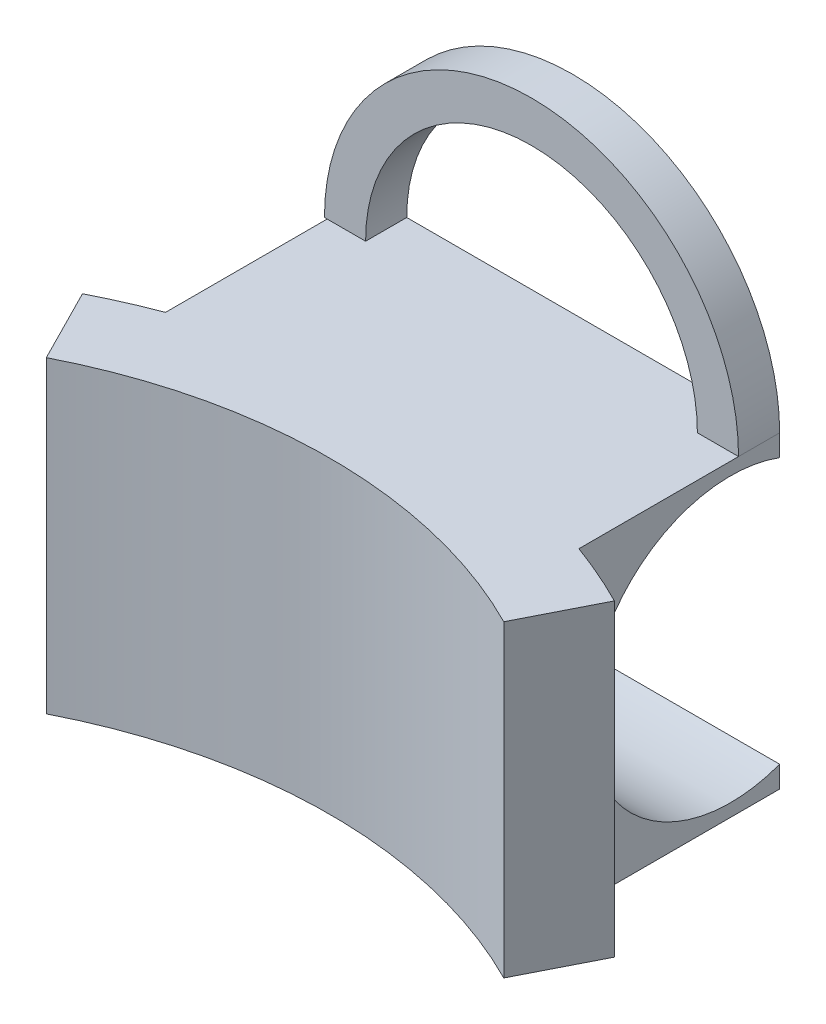
ISO-10303-21;
HEADER;
FILE_DESCRIPTION(('STEP AP214'),'2;1');
FILE_NAME('part.step','',(''),(''),'','','');
FILE_SCHEMA(('AUTOMOTIVE_DESIGN { 1 0 10303 214 1 1 1 1 }'));
ENDSEC;
DATA;
#1=APPLICATION_CONTEXT('core data for automotive mechanical design processes');
#2=APPLICATION_PROTOCOL_DEFINITION('international standard','automotive_design',2000,#1);
#3=PRODUCT_CONTEXT('',#1,'mechanical');
#4=PRODUCT('Part','Part','',(#3));
#5=PRODUCT_RELATED_PRODUCT_CATEGORY('part','',(#4));
#6=PRODUCT_DEFINITION_FORMATION('','',#4);
#7=PRODUCT_DEFINITION_CONTEXT('part definition',#1,'design');
#8=PRODUCT_DEFINITION('design','',#6,#7);
#9=PRODUCT_DEFINITION_SHAPE('','',#8);
#10=(LENGTH_UNIT() NAMED_UNIT(*) SI_UNIT(.MILLI.,.METRE.));
#11=(NAMED_UNIT(*) PLANE_ANGLE_UNIT() SI_UNIT($,.RADIAN.));
#12=(NAMED_UNIT(*) SI_UNIT($,.STERADIAN.) SOLID_ANGLE_UNIT());
#13=UNCERTAINTY_MEASURE_WITH_UNIT(LENGTH_MEASURE(1.E-05),#10,'distance_accuracy_value','');
#14=(GEOMETRIC_REPRESENTATION_CONTEXT(3) GLOBAL_UNCERTAINTY_ASSIGNED_CONTEXT((#13)) GLOBAL_UNIT_ASSIGNED_CONTEXT((#10,
#11,#12)) REPRESENTATION_CONTEXT('',''));
#15=CARTESIAN_POINT('',(0.,0.,0.));
#16=DIRECTION('',(0.,0.,1.));
#17=DIRECTION('',(1.,0.,0.));
#18=AXIS2_PLACEMENT_3D('',#15,#16,#17);
#19=CARTESIAN_POINT('',(0.,0.,0.));
#20=DIRECTION('',(0.,1.,0.));
#21=DIRECTION('',(0.,0.,1.));
#22=AXIS2_PLACEMENT_3D('',#19,#20,#21);
#23=PLANE('',#22);
#24=DIRECTION('',(-1.,0.,0.));
#25=VECTOR('',#24,1.);
#26=CARTESIAN_POINT('',(-6.35,0.,0.));
#27=LINE('',#26,#25);
#28=CARTESIAN_POINT('',(5.08,0.,0.));
#29=VERTEX_POINT('',#28);
#30=CARTESIAN_POINT('',(-5.16308789777071,0.,0.));
#31=VERTEX_POINT('',#30);
#32=EDGE_CURVE('E236',#29,#31,#27,.T.);
#33=ORIENTED_EDGE('',*,*,#32,.T.);
#34=DIRECTION('',(0.,0.,-1.));
#35=VECTOR('',#34,1.);
#36=CARTESIAN_POINT('',(-5.16308789777071,0.,1.27));
#37=LINE('',#36,#35);
#38=CARTESIAN_POINT('',(-5.16308789777071,0.,1.27));
#39=VERTEX_POINT('',#38);
#40=EDGE_CURVE('E64',#39,#31,#37,.T.);
#41=ORIENTED_EDGE('',*,*,#40,.F.);
#42=DIRECTION('',(-1.,0.,0.));
#43=VECTOR('',#42,1.);
#44=CARTESIAN_POINT('',(-5.16308789777071,0.,1.27));
#45=LINE('',#44,#43);
#46=CARTESIAN_POINT('',(-6.35,0.,1.27));
#47=VERTEX_POINT('',#46);
#48=EDGE_CURVE('E161',#39,#47,#45,.T.);
#49=ORIENTED_EDGE('',*,*,#48,.T.);
#50=DIRECTION('',(0.,0.,1.));
#51=VECTOR('',#50,1.);
#52=CARTESIAN_POINT('',(-6.35,0.,0.));
#53=LINE('',#52,#51);
#54=CARTESIAN_POINT('',(-6.35,0.,6.25854232944159));
#55=VERTEX_POINT('',#54);
#56=EDGE_CURVE('E231',#47,#55,#53,.T.);
#57=ORIENTED_EDGE('',*,*,#56,.T.);
#58=CARTESIAN_POINT('',(0.0816708780940097,0.,23.219082168846));
#59=DIRECTION('',(0.,1.,0.));
#60=DIRECTION('',(1.,0.,0.));
#61=AXIS2_PLACEMENT_3D('',#58,#59,#60);
#62=CIRCLE('',#61,18.139082168846);
#63=CARTESIAN_POINT('',(-8.12945462790108,0.,7.04491387947347));
#64=VERTEX_POINT('',#63);
#65=EDGE_CURVE('E212',#64,#55,#62,.F.);
#66=ORIENTED_EDGE('',*,*,#65,.F.);
#67=DIRECTION('',(-0.45267590882287,0.,-0.891675121090293));
#68=VECTOR('',#67,1.);
#69=CARTESIAN_POINT('',(-6.97965781949099,0.,9.30976868704282));
#70=LINE('',#69,#68);
#71=CARTESIAN_POINT('',(-6.97965781949099,0.,9.30976868704282));
#72=VERTEX_POINT('',#71);
#73=EDGE_CURVE('E197',#72,#64,#70,.T.);
#74=ORIENTED_EDGE('',*,*,#73,.F.);
#75=CARTESIAN_POINT('',(0.0816708780940097,0.,23.219082168846));
#76=DIRECTION('',(0.,1.,0.));
#77=DIRECTION('',(1.,0.,0.));
#78=AXIS2_PLACEMENT_3D('',#75,#76,#77);
#79=CIRCLE('',#78,15.599082168846);
#80=CARTESIAN_POINT('',(7.142999575679,0.,9.30976868704282));
#81=VERTEX_POINT('',#80);
#82=EDGE_CURVE('E192',#72,#81,#79,.F.);
#83=ORIENTED_EDGE('',*,*,#82,.T.);
#84=DIRECTION('',(-0.45267590882287,0.,0.891675121090293));
#85=VECTOR('',#84,1.);
#86=CARTESIAN_POINT('',(8.29279638408909,0.,7.04491387947347));
#87=LINE('',#86,#85);
#88=CARTESIAN_POINT('',(8.29279638408909,0.,7.04491387947347));
#89=VERTEX_POINT('',#88);
#90=EDGE_CURVE('E208',#89,#81,#87,.T.);
#91=ORIENTED_EDGE('',*,*,#90,.F.);
#92=CARTESIAN_POINT('',(6.35,0.,6.19749728530439));
#93=VERTEX_POINT('',#92);
#94=EDGE_CURVE('E211',#93,#89,#62,.F.);
#95=ORIENTED_EDGE('',*,*,#94,.F.);
#96=DIRECTION('',(0.,0.,-1.));
#97=VECTOR('',#96,1.);
#98=CARTESIAN_POINT('',(6.35,0.,0.));
#99=LINE('',#98,#97);
#100=CARTESIAN_POINT('',(6.35,0.,1.27));
#101=VERTEX_POINT('',#100);
#102=EDGE_CURVE('E243',#93,#101,#99,.T.);
#103=ORIENTED_EDGE('',*,*,#102,.T.);
#104=DIRECTION('',(-1.,0.,0.));
#105=VECTOR('',#104,1.);
#106=CARTESIAN_POINT('',(6.35,0.,1.27));
#107=LINE('',#106,#105);
#108=CARTESIAN_POINT('',(5.08,0.,1.27));
#109=VERTEX_POINT('',#108);
#110=EDGE_CURVE('E71',#101,#109,#107,.T.);
#111=ORIENTED_EDGE('',*,*,#110,.T.);
#112=DIRECTION('',(0.,0.,-1.));
#113=VECTOR('',#112,1.);
#114=CARTESIAN_POINT('',(5.08,0.,1.27));
#115=LINE('',#114,#113);
#116=EDGE_CURVE('E186',#109,#29,#115,.T.);
#117=ORIENTED_EDGE('',*,*,#116,.T.);
#118=EDGE_LOOP('',(#33,#41,#49,#57,#66,#74,#83,#91,#95,#103,#111,#117));
#119=FACE_BOUND('',#118,.T.);
#120=ADVANCED_FACE('F49',(#119),#23,.T.);
#121=CARTESIAN_POINT('',(-6.35,-9.525,0.));
#122=DIRECTION('',(0.,0.,-1.));
#123=DIRECTION('',(-1.,0.,0.));
#124=AXIS2_PLACEMENT_3D('',#121,#122,#123);
#125=PLANE('',#124);
#126=DIRECTION('',(0.,1.,0.));
#127=VECTOR('',#126,1.);
#128=CARTESIAN_POINT('',(-6.35,-9.525,0.));
#129=LINE('',#128,#127);
#130=CARTESIAN_POINT('',(-6.35,-0.664253574886776,0.));
#131=VERTEX_POINT('',#130);
#132=CARTESIAN_POINT('',(-6.35,0.,0.));
#133=VERTEX_POINT('',#132);
#134=EDGE_CURVE('E249',#131,#133,#129,.T.);
#135=ORIENTED_EDGE('',*,*,#134,.T.);
#136=DIRECTION('',(-1.,0.,0.));
#137=VECTOR('',#136,1.);
#138=CARTESIAN_POINT('',(-5.16308789777071,0.,0.));
#139=LINE('',#138,#137);
#140=CARTESIAN_POINT('',(-6.43308789777071,0.,0.));
#141=VERTEX_POINT('',#140);
#142=EDGE_CURVE('E182',#133,#141,#139,.T.);
#143=ORIENTED_EDGE('',*,*,#142,.T.);
#144=CARTESIAN_POINT('',(-0.0415439488853568,0.,0.));
#145=DIRECTION('',(0.,0.,-1.));
#146=DIRECTION('',(-1.,0.,0.));
#147=AXIS2_PLACEMENT_3D('',#144,#145,#146);
#148=CIRCLE('',#147,6.39154394888536);
#149=CARTESIAN_POINT('',(6.35,0.,0.));
#150=VERTEX_POINT('',#149);
#151=EDGE_CURVE('E169',#141,#150,#148,.T.);
#152=ORIENTED_EDGE('',*,*,#151,.T.);
#153=DIRECTION('',(0.,1.,0.));
#154=VECTOR('',#153,1.);
#155=CARTESIAN_POINT('',(6.35,-9.525,0.));
#156=LINE('',#155,#154);
#157=CARTESIAN_POINT('',(6.35,-0.664253574886776,0.));
#158=VERTEX_POINT('',#157);
#159=EDGE_CURVE('E241',#158,#150,#156,.T.);
#160=ORIENTED_EDGE('',*,*,#159,.F.);
#161=DIRECTION('',(1.,0.,0.));
#162=VECTOR('',#161,1.);
#163=CARTESIAN_POINT('',(-8.12945462790108,-0.664253574886776,0.));
#164=LINE('',#163,#162);
#165=EDGE_CURVE('E13',#131,#158,#164,.T.);
#166=ORIENTED_EDGE('',*,*,#165,.F.);
#167=EDGE_LOOP('',(#135,#143,#152,#160,#166));
#168=FACE_BOUND('',#167,.T.);
#169=CARTESIAN_POINT('',(-0.0415439488853568,0.,0.));
#170=DIRECTION('',(0.,0.,1.));
#171=DIRECTION('',(1.,0.,0.));
#172=AXIS2_PLACEMENT_3D('',#169,#170,#171);
#173=CIRCLE('',#172,5.12154394888536);
#174=EDGE_CURVE('E178',#31,#29,#173,.F.);
#175=ORIENTED_EDGE('',*,*,#174,.F.);
#176=ORIENTED_EDGE('',*,*,#32,.F.);
#177=EDGE_LOOP('',(#175,#176));
#178=FACE_BOUND('',#177,.T.);
#179=ADVANCED_FACE('F282',(#168,#178),#125,.T.);
#180=CARTESIAN_POINT('',(-6.35,-9.525,0.));
#181=DIRECTION('',(-1.,0.,0.));
#182=DIRECTION('',(0.,0.,1.));
#183=AXIS2_PLACEMENT_3D('',#180,#181,#182);
#184=PLANE('',#183);
#185=CARTESIAN_POINT('',(-6.35,-4.7625,1.51703384428801));
#186=DIRECTION('',(-1.,0.,0.));
#187=DIRECTION('',(0.,0.,1.));
#188=AXIS2_PLACEMENT_3D('',#185,#186,#187);
#189=CIRCLE('',#188,4.3700132088666);
#190=CARTESIAN_POINT('',(-6.35,-8.86074642511323,0.));
#191=VERTEX_POINT('',#190);
#192=EDGE_CURVE('E190',#191,#131,#189,.T.);
#193=ORIENTED_EDGE('',*,*,#192,.F.);
#194=CARTESIAN_POINT('',(-6.35,-9.525,0.));
#195=VERTEX_POINT('',#194);
#196=EDGE_CURVE('E246',#195,#191,#129,.T.);
#197=ORIENTED_EDGE('',*,*,#196,.F.);
#198=DIRECTION('',(0.,0.,1.));
#199=VECTOR('',#198,1.);
#200=CARTESIAN_POINT('',(-6.35,-9.525,0.));
#201=LINE('',#200,#199);
#202=CARTESIAN_POINT('',(-6.35,-9.525,6.25854232944159));
#203=VERTEX_POINT('',#202);
#204=EDGE_CURVE('E232',#195,#203,#201,.T.);
#205=ORIENTED_EDGE('',*,*,#204,.T.);
#206=DIRECTION('',(0.,1.,0.));
#207=VECTOR('',#206,1.);
#208=CARTESIAN_POINT('',(-6.35,-9.525,6.25854232944159));
#209=LINE('',#208,#207);
#210=EDGE_CURVE('E228',#203,#55,#209,.T.);
#211=ORIENTED_EDGE('',*,*,#210,.T.);
#212=ORIENTED_EDGE('',*,*,#56,.F.);
#213=EDGE_CURVE('E157',#133,#47,#53,.T.);
#214=ORIENTED_EDGE('',*,*,#213,.F.);
#215=ORIENTED_EDGE('',*,*,#134,.F.);
#216=EDGE_LOOP('',(#193,#197,#205,#211,#212,#214,#215));
#217=FACE_BOUND('',#216,.T.);
#218=ADVANCED_FACE('F51',(#217),#184,.T.);
#219=CARTESIAN_POINT('',(6.35,-9.525,0.));
#220=DIRECTION('',(1.,0.,0.));
#221=DIRECTION('',(0.,0.,-1.));
#222=AXIS2_PLACEMENT_3D('',#219,#220,#221);
#223=PLANE('',#222);
#224=CARTESIAN_POINT('',(6.35,-4.7625,1.51703384428801));
#225=DIRECTION('',(1.,0.,0.));
#226=DIRECTION('',(0.,0.,-1.));
#227=AXIS2_PLACEMENT_3D('',#224,#225,#226);
#228=CIRCLE('',#227,4.3700132088666);
#229=CARTESIAN_POINT('',(6.35,-8.86074642511323,0.));
#230=VERTEX_POINT('',#229);
#231=EDGE_CURVE('E188',#158,#230,#228,.T.);
#232=ORIENTED_EDGE('',*,*,#231,.F.);
#233=ORIENTED_EDGE('',*,*,#159,.T.);
#234=DIRECTION('',(0.,0.,-1.));
#235=VECTOR('',#234,1.);
#236=CARTESIAN_POINT('',(6.35,0.,1.27));
#237=LINE('',#236,#235);
#238=EDGE_CURVE('E170',#101,#150,#237,.T.);
#239=ORIENTED_EDGE('',*,*,#238,.F.);
#240=ORIENTED_EDGE('',*,*,#102,.F.);
#241=DIRECTION('',(0.,1.,0.));
#242=VECTOR('',#241,1.);
#243=CARTESIAN_POINT('',(6.35,-9.525,6.1974972853044));
#244=LINE('',#243,#242);
#245=CARTESIAN_POINT('',(6.35,-9.525,6.19749728530439));
#246=VERTEX_POINT('',#245);
#247=EDGE_CURVE('E218',#93,#246,#244,.F.);
#248=ORIENTED_EDGE('',*,*,#247,.T.);
#249=DIRECTION('',(0.,0.,-1.));
#250=VECTOR('',#249,1.);
#251=CARTESIAN_POINT('',(6.35,-9.525,0.));
#252=LINE('',#251,#250);
#253=CARTESIAN_POINT('',(6.35,-9.525,0.));
#254=VERTEX_POINT('',#253);
#255=EDGE_CURVE('E235',#246,#254,#252,.T.);
#256=ORIENTED_EDGE('',*,*,#255,.T.);
#257=EDGE_CURVE('E250',#254,#230,#156,.T.);
#258=ORIENTED_EDGE('',*,*,#257,.T.);
#259=EDGE_LOOP('',(#232,#233,#239,#240,#248,#256,#258));
#260=FACE_BOUND('',#259,.T.);
#261=ADVANCED_FACE('F290',(#260),#223,.T.);
#262=DIRECTION('',(1.,0.,0.));
#263=VECTOR('',#262,1.);
#264=CARTESIAN_POINT('',(-8.12945462790108,-8.86074642511323,0.));
#265=LINE('',#264,#263);
#266=EDGE_CURVE('E57',#230,#191,#265,.F.);
#267=ORIENTED_EDGE('',*,*,#266,.F.);
#268=ORIENTED_EDGE('',*,*,#257,.F.);
#269=DIRECTION('',(-1.,0.,0.));
#270=VECTOR('',#269,1.);
#271=CARTESIAN_POINT('',(-6.35,-9.525,0.));
#272=LINE('',#271,#270);
#273=EDGE_CURVE('E238',#254,#195,#272,.T.);
#274=ORIENTED_EDGE('',*,*,#273,.T.);
#275=ORIENTED_EDGE('',*,*,#196,.T.);
#276=EDGE_LOOP('',(#267,#268,#274,#275));
#277=FACE_BOUND('',#276,.T.);
#278=ADVANCED_FACE('F264',(#277),#125,.T.);
#279=CARTESIAN_POINT('',(0.,-9.525,0.));
#280=DIRECTION('',(0.,1.,0.));
#281=DIRECTION('',(0.,0.,1.));
#282=AXIS2_PLACEMENT_3D('',#279,#280,#281);
#283=PLANE('',#282);
#284=ORIENTED_EDGE('',*,*,#255,.F.);
#285=CARTESIAN_POINT('',(0.0816708780940097,-9.525,23.219082168846));
#286=DIRECTION('',(0.,1.,0.));
#287=DIRECTION('',(1.,0.,0.));
#288=AXIS2_PLACEMENT_3D('',#285,#286,#287);
#289=CIRCLE('',#288,18.139082168846);
#290=CARTESIAN_POINT('',(8.29279638408909,-9.525,7.04491387947347));
#291=VERTEX_POINT('',#290);
#292=EDGE_CURVE('E199',#246,#291,#289,.F.);
#293=ORIENTED_EDGE('',*,*,#292,.T.);
#294=DIRECTION('',(-0.45267590882287,0.,0.891675121090293));
#295=VECTOR('',#294,1.);
#296=CARTESIAN_POINT('',(8.29279638408909,-9.525,7.04491387947347));
#297=LINE('',#296,#295);
#298=CARTESIAN_POINT('',(7.142999575679,-9.525,9.30976868704282));
#299=VERTEX_POINT('',#298);
#300=EDGE_CURVE('E196',#291,#299,#297,.T.);
#301=ORIENTED_EDGE('',*,*,#300,.T.);
#302=CARTESIAN_POINT('',(0.0816708780940097,-9.525,23.219082168846));
#303=DIRECTION('',(0.,1.,0.));
#304=DIRECTION('',(1.,0.,0.));
#305=AXIS2_PLACEMENT_3D('',#302,#303,#304);
#306=CIRCLE('',#305,15.599082168846);
#307=CARTESIAN_POINT('',(-6.97965781949099,-9.525,9.30976868704282));
#308=VERTEX_POINT('',#307);
#309=EDGE_CURVE('E193',#308,#299,#306,.F.);
#310=ORIENTED_EDGE('',*,*,#309,.F.);
#311=DIRECTION('',(-0.45267590882287,0.,-0.891675121090293));
#312=VECTOR('',#311,1.);
#313=CARTESIAN_POINT('',(-6.97965781949099,-9.525,9.30976868704282));
#314=LINE('',#313,#312);
#315=CARTESIAN_POINT('',(-8.12945462790108,-9.525,7.04491387947347));
#316=VERTEX_POINT('',#315);
#317=EDGE_CURVE('E203',#308,#316,#314,.T.);
#318=ORIENTED_EDGE('',*,*,#317,.T.);
#319=EDGE_CURVE('E200',#316,#203,#289,.F.);
#320=ORIENTED_EDGE('',*,*,#319,.T.);
#321=ORIENTED_EDGE('',*,*,#204,.F.);
#322=ORIENTED_EDGE('',*,*,#273,.F.);
#323=EDGE_LOOP('',(#284,#293,#301,#310,#318,#320,#321,#322));
#324=FACE_BOUND('',#323,.T.);
#325=ADVANCED_FACE('F268',(#324),#283,.F.);
#326=CARTESIAN_POINT('',(0.0816708780940097,-9.525,23.219082168846));
#327=DIRECTION('',(0.,1.,0.));
#328=DIRECTION('',(0.,0.,1.));
#329=AXIS2_PLACEMENT_3D('',#326,#327,#328);
#330=CYLINDRICAL_SURFACE('',#329,18.139082168846);
#331=ORIENTED_EDGE('',*,*,#210,.F.);
#332=ORIENTED_EDGE('',*,*,#319,.F.);
#333=DIRECTION('',(0.,1.,0.));
#334=VECTOR('',#333,1.);
#335=CARTESIAN_POINT('',(-8.12945462790108,-9.525,7.04491387947347));
#336=LINE('',#335,#334);
#337=EDGE_CURVE('E219',#316,#64,#336,.T.);
#338=ORIENTED_EDGE('',*,*,#337,.T.);
#339=ORIENTED_EDGE('',*,*,#65,.T.);
#340=EDGE_LOOP('',(#331,#332,#338,#339));
#341=FACE_BOUND('',#340,.T.);
#342=ADVANCED_FACE('F272',(#341),#330,.T.);
#343=CARTESIAN_POINT('',(0.0816708780940097,-9.525,23.219082168846));
#344=DIRECTION('',(0.,1.,0.));
#345=DIRECTION('',(0.,0.,1.));
#346=AXIS2_PLACEMENT_3D('',#343,#344,#345);
#347=CYLINDRICAL_SURFACE('',#346,15.599082168846);
#348=ORIENTED_EDGE('',*,*,#82,.F.);
#349=DIRECTION('',(0.,1.,0.));
#350=VECTOR('',#349,1.);
#351=CARTESIAN_POINT('',(-6.97965781949099,-9.525,9.30976868704282));
#352=LINE('',#351,#350);
#353=EDGE_CURVE('E216',#308,#72,#352,.T.);
#354=ORIENTED_EDGE('',*,*,#353,.F.);
#355=ORIENTED_EDGE('',*,*,#309,.T.);
#356=DIRECTION('',(0.,1.,0.));
#357=VECTOR('',#356,1.);
#358=CARTESIAN_POINT('',(7.142999575679,-9.525,9.30976868704282));
#359=LINE('',#358,#357);
#360=EDGE_CURVE('E205',#299,#81,#359,.T.);
#361=ORIENTED_EDGE('',*,*,#360,.T.);
#362=EDGE_LOOP('',(#348,#354,#355,#361));
#363=FACE_BOUND('',#362,.T.);
#364=ADVANCED_FACE('F315',(#363),#347,.F.);
#365=CARTESIAN_POINT('',(-6.97965781949099,-9.525,9.30976868704282));
#366=DIRECTION('',(0.891675121090293,0.,-0.45267590882287));
#367=DIRECTION('',(-0.45267590882287,0.,-0.891675121090293));
#368=AXIS2_PLACEMENT_3D('',#365,#366,#367);
#369=PLANE('',#368);
#370=ORIENTED_EDGE('',*,*,#73,.T.);
#371=ORIENTED_EDGE('',*,*,#337,.F.);
#372=ORIENTED_EDGE('',*,*,#317,.F.);
#373=ORIENTED_EDGE('',*,*,#353,.T.);
#374=EDGE_LOOP('',(#370,#371,#372,#373));
#375=FACE_BOUND('',#374,.T.);
#376=ADVANCED_FACE('F317',(#375),#369,.F.);
#377=ORIENTED_EDGE('',*,*,#247,.F.);
#378=ORIENTED_EDGE('',*,*,#94,.T.);
#379=DIRECTION('',(0.,1.,0.));
#380=VECTOR('',#379,1.);
#381=CARTESIAN_POINT('',(8.29279638408909,-9.525,7.04491387947347));
#382=LINE('',#381,#380);
#383=EDGE_CURVE('E222',#291,#89,#382,.T.);
#384=ORIENTED_EDGE('',*,*,#383,.F.);
#385=ORIENTED_EDGE('',*,*,#292,.F.);
#386=EDGE_LOOP('',(#377,#378,#384,#385));
#387=FACE_BOUND('',#386,.T.);
#388=ADVANCED_FACE('F305',(#387),#330,.T.);
#389=CARTESIAN_POINT('',(8.29279638408909,-9.525,7.04491387947347));
#390=DIRECTION('',(-0.891675121090293,0.,-0.45267590882287));
#391=DIRECTION('',(-0.45267590882287,0.,0.891675121090293));
#392=AXIS2_PLACEMENT_3D('',#389,#390,#391);
#393=PLANE('',#392);
#394=ORIENTED_EDGE('',*,*,#90,.T.);
#395=ORIENTED_EDGE('',*,*,#360,.F.);
#396=ORIENTED_EDGE('',*,*,#300,.F.);
#397=ORIENTED_EDGE('',*,*,#383,.T.);
#398=EDGE_LOOP('',(#394,#395,#396,#397));
#399=FACE_BOUND('',#398,.T.);
#400=ADVANCED_FACE('F310',(#399),#393,.F.);
#401=CARTESIAN_POINT('',(-8.12945462790108,-4.7625,1.51703384428801));
#402=DIRECTION('',(1.,0.,0.));
#403=DIRECTION('',(0.,0.,-1.));
#404=AXIS2_PLACEMENT_3D('',#401,#402,#403);
#405=CYLINDRICAL_SURFACE('',#404,4.3700132088666);
#406=ORIENTED_EDGE('',*,*,#165,.T.);
#407=ORIENTED_EDGE('',*,*,#231,.T.);
#408=ORIENTED_EDGE('',*,*,#266,.T.);
#409=ORIENTED_EDGE('',*,*,#192,.T.);
#410=EDGE_LOOP('',(#406,#407,#408,#409));
#411=FACE_BOUND('',#410,.T.);
#412=ADVANCED_FACE('F255',(#411),#405,.F.);
#413=CARTESIAN_POINT('',(-0.0415439488853568,0.,1.27));
#414=DIRECTION('',(0.,0.,-1.));
#415=DIRECTION('',(-1.,0.,0.));
#416=AXIS2_PLACEMENT_3D('',#413,#414,#415);
#417=CYLINDRICAL_SURFACE('',#416,5.12154394888536);
#418=ORIENTED_EDGE('',*,*,#174,.T.);
#419=ORIENTED_EDGE('',*,*,#116,.F.);
#420=CARTESIAN_POINT('',(-0.0415439488853568,0.,1.27));
#421=DIRECTION('',(0.,0.,1.));
#422=DIRECTION('',(1.,0.,0.));
#423=AXIS2_PLACEMENT_3D('',#420,#421,#422);
#424=CIRCLE('',#423,5.12154394888536);
#425=EDGE_CURVE('E174',#39,#109,#424,.F.);
#426=ORIENTED_EDGE('',*,*,#425,.F.);
#427=ORIENTED_EDGE('',*,*,#40,.T.);
#428=EDGE_LOOP('',(#418,#419,#426,#427));
#429=FACE_BOUND('',#428,.T.);
#430=ADVANCED_FACE('F279',(#429),#417,.F.);
#431=CARTESIAN_POINT('',(-0.0415439488853568,0.,1.27));
#432=DIRECTION('',(0.,0.,-1.));
#433=DIRECTION('',(-1.,0.,0.));
#434=AXIS2_PLACEMENT_3D('',#431,#432,#433);
#435=CYLINDRICAL_SURFACE('',#434,6.39154394888536);
#436=ORIENTED_EDGE('',*,*,#151,.F.);
#437=DIRECTION('',(0.,0.,-1.));
#438=VECTOR('',#437,1.);
#439=CARTESIAN_POINT('',(-6.43308789777071,0.,1.27));
#440=LINE('',#439,#438);
#441=CARTESIAN_POINT('',(-6.43308789777071,0.,1.27));
#442=VERTEX_POINT('',#441);
#443=EDGE_CURVE('E155',#442,#141,#440,.T.);
#444=ORIENTED_EDGE('',*,*,#443,.F.);
#445=CARTESIAN_POINT('',(-0.0415439488853568,0.,1.27));
#446=DIRECTION('',(0.,0.,-1.));
#447=DIRECTION('',(-1.,0.,0.));
#448=AXIS2_PLACEMENT_3D('',#445,#446,#447);
#449=CIRCLE('',#448,6.39154394888536);
#450=EDGE_CURVE('E162',#442,#101,#449,.T.);
#451=ORIENTED_EDGE('',*,*,#450,.T.);
#452=ORIENTED_EDGE('',*,*,#238,.T.);
#453=EDGE_LOOP('',(#436,#444,#451,#452));
#454=FACE_BOUND('',#453,.T.);
#455=ADVANCED_FACE('F166',(#454),#435,.T.);
#456=CARTESIAN_POINT('',(-5.16308789777071,0.,1.27));
#457=DIRECTION('',(0.,-1.,0.));
#458=DIRECTION('',(1.,0.,0.));
#459=AXIS2_PLACEMENT_3D('',#456,#457,#458);
#460=PLANE('',#459);
#461=ORIENTED_EDGE('',*,*,#142,.F.);
#462=ORIENTED_EDGE('',*,*,#213,.T.);
#463=EDGE_CURVE('E151',#47,#442,#45,.T.);
#464=ORIENTED_EDGE('',*,*,#463,.T.);
#465=ORIENTED_EDGE('',*,*,#443,.T.);
#466=EDGE_LOOP('',(#461,#462,#464,#465));
#467=FACE_BOUND('',#466,.T.);
#468=ADVANCED_FACE('F154',(#467),#460,.T.);
#469=CARTESIAN_POINT('',(-0.0415439488853568,0.,1.27));
#470=DIRECTION('',(0.,0.,1.));
#471=DIRECTION('',(1.,0.,0.));
#472=AXIS2_PLACEMENT_3D('',#469,#470,#471);
#473=PLANE('',#472);
#474=ORIENTED_EDGE('',*,*,#425,.T.);
#475=ORIENTED_EDGE('',*,*,#110,.F.);
#476=ORIENTED_EDGE('',*,*,#450,.F.);
#477=ORIENTED_EDGE('',*,*,#463,.F.);
#478=ORIENTED_EDGE('',*,*,#48,.F.);
#479=EDGE_LOOP('',(#474,#475,#476,#477,#478));
#480=FACE_BOUND('',#479,.T.);
#481=ADVANCED_FACE('F172',(#480),#473,.T.);
#482=CLOSED_SHELL('',(#120,#179,#218,#261,#278,#325,#342,#364,#376,#388,#400,#412,#430,#455,
#468,#481));
#483=MANIFOLD_SOLID_BREP('B2',#482);
#484=ADVANCED_BREP_SHAPE_REPRESENTATION('',(#18,#483),#14);
#485=SHAPE_DEFINITION_REPRESENTATION(#9,#484);
ENDSEC;
END-ISO-10303-21;
